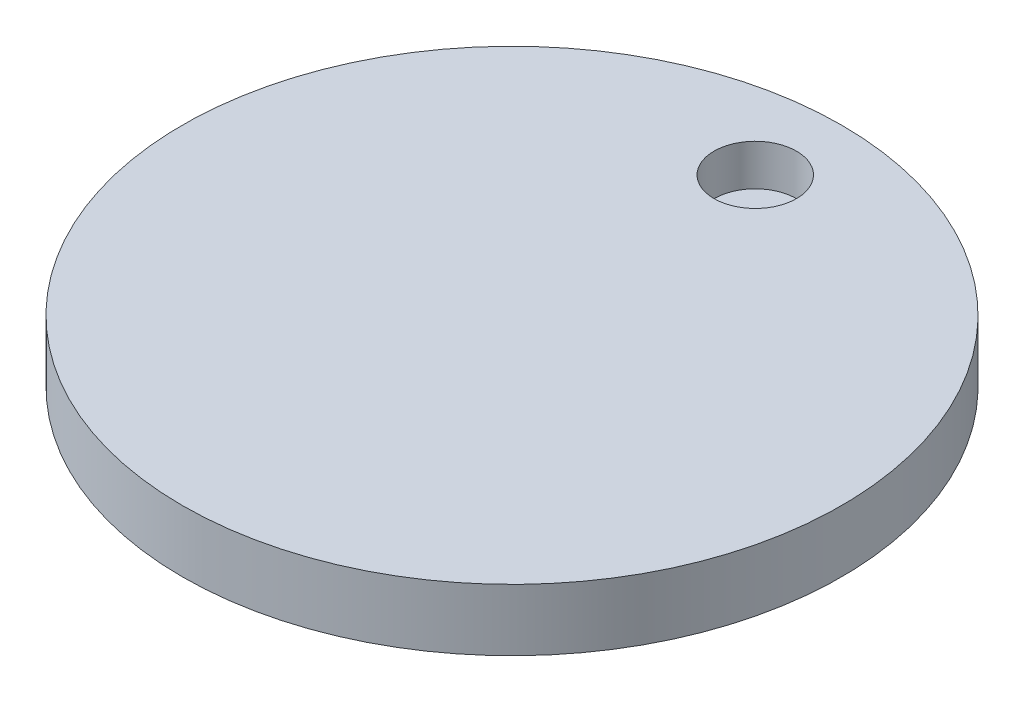
ISO-10303-21;
HEADER;
FILE_DESCRIPTION(('STEP AP214'),'2;1');
FILE_NAME('part.step','',(''),(''),'','','');
FILE_SCHEMA(('AUTOMOTIVE_DESIGN { 1 0 10303 214 1 1 1 1 }'));
ENDSEC;
DATA;
#1=APPLICATION_CONTEXT('core data for automotive mechanical design processes');
#2=APPLICATION_PROTOCOL_DEFINITION('international standard','automotive_design',2000,#1);
#3=PRODUCT_CONTEXT('',#1,'mechanical');
#4=PRODUCT('Part','Part','',(#3));
#5=PRODUCT_RELATED_PRODUCT_CATEGORY('part','',(#4));
#6=PRODUCT_DEFINITION_FORMATION('','',#4);
#7=PRODUCT_DEFINITION_CONTEXT('part definition',#1,'design');
#8=PRODUCT_DEFINITION('design','',#6,#7);
#9=PRODUCT_DEFINITION_SHAPE('','',#8);
#10=(LENGTH_UNIT() NAMED_UNIT(*) SI_UNIT(.MILLI.,.METRE.));
#11=(NAMED_UNIT(*) PLANE_ANGLE_UNIT() SI_UNIT($,.RADIAN.));
#12=(NAMED_UNIT(*) SI_UNIT($,.STERADIAN.) SOLID_ANGLE_UNIT());
#13=UNCERTAINTY_MEASURE_WITH_UNIT(LENGTH_MEASURE(1.E-05),#10,'distance_accuracy_value','');
#14=(GEOMETRIC_REPRESENTATION_CONTEXT(3) GLOBAL_UNCERTAINTY_ASSIGNED_CONTEXT((#13)) GLOBAL_UNIT_ASSIGNED_CONTEXT((#10,
#11,#12)) REPRESENTATION_CONTEXT('',''));
#15=CARTESIAN_POINT('',(0.,0.,0.));
#16=DIRECTION('',(0.,0.,1.));
#17=DIRECTION('',(1.,0.,0.));
#18=AXIS2_PLACEMENT_3D('',#15,#16,#17);
#19=CARTESIAN_POINT('',(0.,19.05,0.));
#20=DIRECTION('',(0.,-1.,0.));
#21=DIRECTION('',(0.,0.,-1.));
#22=AXIS2_PLACEMENT_3D('',#19,#20,#21);
#23=CYLINDRICAL_SURFACE('',#22,101.6);
#24=CARTESIAN_POINT('',(0.,19.05,0.));
#25=DIRECTION('',(0.,1.,0.));
#26=DIRECTION('',(0.,0.,1.));
#27=AXIS2_PLACEMENT_3D('',#24,#25,#26);
#28=CIRCLE('',#27,101.6);
#29=CARTESIAN_POINT('',(0.,19.05,101.6));
#30=VERTEX_POINT('',#29);
#31=EDGE_CURVE('E10',#30,#30,#28,.T.);
#32=ORIENTED_EDGE('',*,*,#31,.F.);
#33=EDGE_LOOP('',(#32));
#34=FACE_BOUND('',#33,.T.);
#35=CARTESIAN_POINT('',(0.,0.,0.));
#36=DIRECTION('',(0.,1.,0.));
#37=DIRECTION('',(0.,0.,1.));
#38=AXIS2_PLACEMENT_3D('',#35,#36,#37);
#39=CIRCLE('',#38,101.6);
#40=CARTESIAN_POINT('',(0.,0.,101.6));
#41=VERTEX_POINT('',#40);
#42=EDGE_CURVE('E39',#41,#41,#39,.T.);
#43=ORIENTED_EDGE('',*,*,#42,.T.);
#44=EDGE_LOOP('',(#43));
#45=FACE_BOUND('',#44,.T.);
#46=ADVANCED_FACE('F36',(#34,#45),#23,.T.);
#47=CARTESIAN_POINT('',(0.,19.05,0.));
#48=DIRECTION('',(0.,1.,0.));
#49=DIRECTION('',(0.,0.,1.));
#50=AXIS2_PLACEMENT_3D('',#47,#48,#49);
#51=PLANE('',#50);
#52=CARTESIAN_POINT('',(0.,19.05,-75.));
#53=DIRECTION('',(0.,1.,0.));
#54=DIRECTION('',(0.,0.,1.));
#55=AXIS2_PLACEMENT_3D('',#52,#53,#54);
#56=CIRCLE('',#55,12.7);
#57=CARTESIAN_POINT('',(0.,19.05,-62.3));
#58=VERTEX_POINT('',#57);
#59=EDGE_CURVE('E50',#58,#58,#56,.T.);
#60=ORIENTED_EDGE('',*,*,#59,.F.);
#61=EDGE_LOOP('',(#60));
#62=FACE_BOUND('',#61,.T.);
#63=ORIENTED_EDGE('',*,*,#31,.T.);
#64=EDGE_LOOP('',(#63));
#65=FACE_BOUND('',#64,.T.);
#66=ADVANCED_FACE('F67',(#62,#65),#51,.T.);
#67=CARTESIAN_POINT('',(0.,0.,0.));
#68=DIRECTION('',(0.,1.,0.));
#69=DIRECTION('',(0.,0.,1.));
#70=AXIS2_PLACEMENT_3D('',#67,#68,#69);
#71=PLANE('',#70);
#72=ORIENTED_EDGE('',*,*,#42,.F.);
#73=EDGE_LOOP('',(#72));
#74=FACE_BOUND('',#73,.T.);
#75=ADVANCED_FACE('F63',(#74),#71,.F.);
#76=CARTESIAN_POINT('',(0.,6.35,-75.));
#77=DIRECTION('',(0.,1.,0.));
#78=DIRECTION('',(0.,0.,1.));
#79=AXIS2_PLACEMENT_3D('',#76,#77,#78);
#80=CYLINDRICAL_SURFACE('',#79,12.7);
#81=CARTESIAN_POINT('',(0.,6.35,-75.));
#82=DIRECTION('',(0.,1.,0.));
#83=DIRECTION('',(0.,0.,1.));
#84=AXIS2_PLACEMENT_3D('',#81,#82,#83);
#85=CIRCLE('',#84,12.7);
#86=CARTESIAN_POINT('',(0.,6.35,-62.3));
#87=VERTEX_POINT('',#86);
#88=EDGE_CURVE('E48',#87,#87,#85,.T.);
#89=ORIENTED_EDGE('',*,*,#88,.F.);
#90=EDGE_LOOP('',(#89));
#91=FACE_BOUND('',#90,.T.);
#92=ORIENTED_EDGE('',*,*,#59,.T.);
#93=EDGE_LOOP('',(#92));
#94=FACE_BOUND('',#93,.T.);
#95=ADVANCED_FACE('F60',(#91,#94),#80,.F.);
#96=CARTESIAN_POINT('',(0.,6.35,-75.));
#97=DIRECTION('',(0.,1.,0.));
#98=DIRECTION('',(0.,0.,1.));
#99=AXIS2_PLACEMENT_3D('',#96,#97,#98);
#100=PLANE('',#99);
#101=ORIENTED_EDGE('',*,*,#88,.T.);
#102=EDGE_LOOP('',(#101));
#103=FACE_BOUND('',#102,.T.);
#104=ADVANCED_FACE('F58',(#103),#100,.T.);
#105=CLOSED_SHELL('',(#46,#66,#75,#95,#104));
#106=MANIFOLD_SOLID_BREP('B2',#105);
#107=ADVANCED_BREP_SHAPE_REPRESENTATION('',(#18,#106),#14);
#108=SHAPE_DEFINITION_REPRESENTATION(#9,#107);
ENDSEC;
END-ISO-10303-21;
